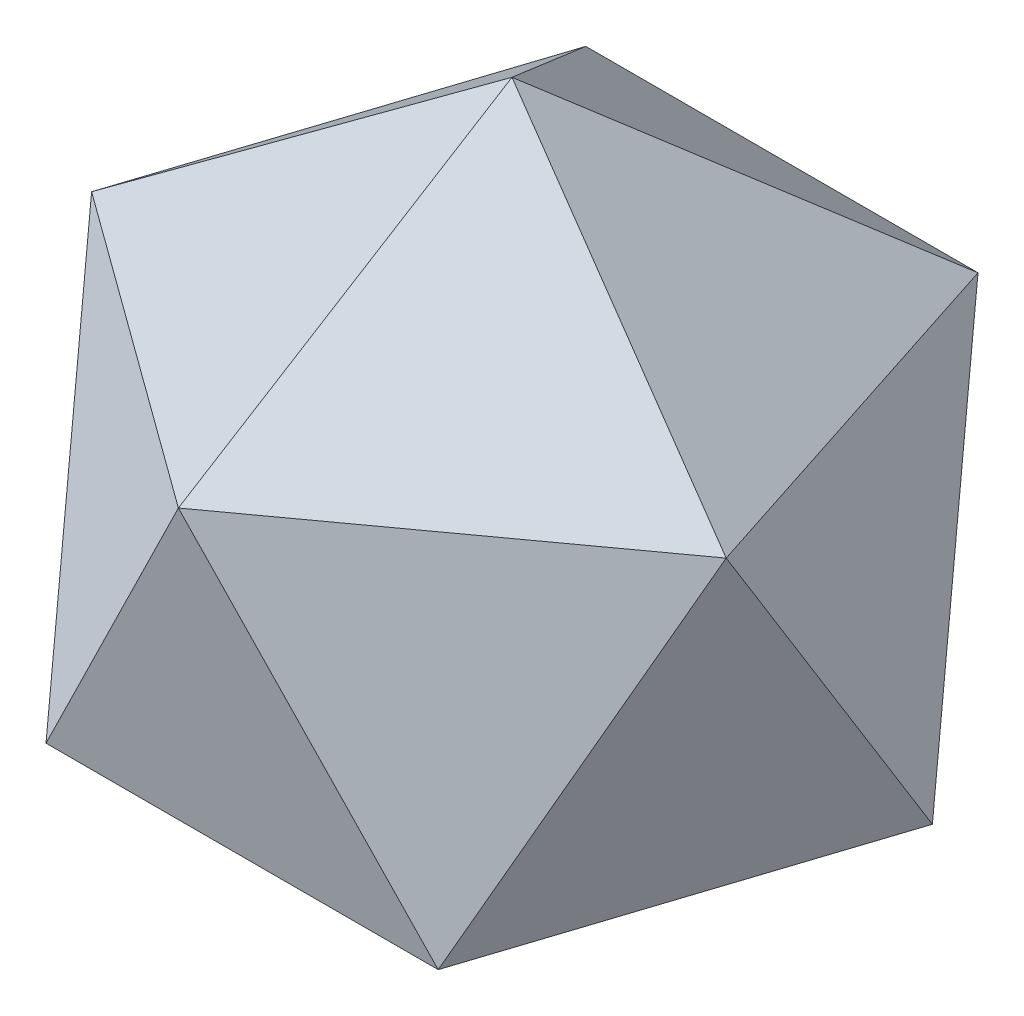
ISO-10303-21;
HEADER;
FILE_DESCRIPTION(('STEP AP214'),'2;1');
FILE_NAME('part.step','',(''),(''),'','','');
FILE_SCHEMA(('AUTOMOTIVE_DESIGN { 1 0 10303 214 1 1 1 1 }'));
ENDSEC;
DATA;
#1=APPLICATION_CONTEXT('core data for automotive mechanical design processes');
#2=APPLICATION_PROTOCOL_DEFINITION('international standard','automotive_design',2000,#1);
#3=PRODUCT_CONTEXT('',#1,'mechanical');
#4=PRODUCT('Part','Part','',(#3));
#5=PRODUCT_RELATED_PRODUCT_CATEGORY('part','',(#4));
#6=PRODUCT_DEFINITION_FORMATION('','',#4);
#7=PRODUCT_DEFINITION_CONTEXT('part definition',#1,'design');
#8=PRODUCT_DEFINITION('design','',#6,#7);
#9=PRODUCT_DEFINITION_SHAPE('','',#8);
#10=(LENGTH_UNIT() NAMED_UNIT(*) SI_UNIT(.MILLI.,.METRE.));
#11=(NAMED_UNIT(*) PLANE_ANGLE_UNIT() SI_UNIT($,.RADIAN.));
#12=(NAMED_UNIT(*) SI_UNIT($,.STERADIAN.) SOLID_ANGLE_UNIT());
#13=UNCERTAINTY_MEASURE_WITH_UNIT(LENGTH_MEASURE(1.E-05),#10,'distance_accuracy_value','');
#14=(GEOMETRIC_REPRESENTATION_CONTEXT(3) GLOBAL_UNCERTAINTY_ASSIGNED_CONTEXT((#13)) GLOBAL_UNIT_ASSIGNED_CONTEXT((#10,
#11,#12)) REPRESENTATION_CONTEXT('',''));
#15=CARTESIAN_POINT('',(0.,0.,0.));
#16=DIRECTION('',(0.,0.,1.));
#17=DIRECTION('',(1.,0.,0.));
#18=AXIS2_PLACEMENT_3D('',#15,#16,#17);
#19=CARTESIAN_POINT('',(-10.2589451239174,-3.33333333333333,-14.1202265916661));
#20=DIRECTION('',(0.577350269189618,0.187592474085079,0.794654472291772));
#21=DIRECTION('',(0.809016994374954,0.,-0.587785252292465));
#22=AXIS2_PLACEMENT_3D('',#19,#20,#21);
#23=PLANE('',#22);
#24=DIRECTION('',(0.809016994374954,0.,-0.587785252292465));
#25=VECTOR('',#24,1.);
#26=CARTESIAN_POINT('',(2.28983498828939E-13,0.,-22.3606797749979));
#27=LINE('',#26,#25);
#28=CARTESIAN_POINT('',(-21.266270208801,0.,-6.90983005625071));
#29=VERTEX_POINT('',#28);
#30=CARTESIAN_POINT('',(0.,0.,-22.3606797749979));
#31=VERTEX_POINT('',#30);
#32=EDGE_CURVE('E135',#29,#31,#27,.T.);
#33=ORIENTED_EDGE('',*,*,#32,.F.);
#34=DIRECTION('',(0.309016994374952,0.85065080835204,-0.425325404176017));
#35=VECTOR('',#34,1.);
#36=CARTESIAN_POINT('',(-13.1432778029782,22.3606797749979,-18.0901699437496));
#37=LINE('',#36,#35);
#38=CARTESIAN_POINT('',(-13.1432778029782,22.3606797749979,-18.0901699437496));
#39=VERTEX_POINT('',#38);
#40=EDGE_CURVE('E142',#29,#39,#37,.T.);
#41=ORIENTED_EDGE('',*,*,#40,.T.);
#42=DIRECTION('',(0.500000000000002,-0.85065080835204,-0.162459848116448));
#43=VECTOR('',#42,1.);
#44=CARTESIAN_POINT('',(-13.1432778029781,22.3606797749979,-18.0901699437496));
#45=LINE('',#44,#43);
#46=EDGE_CURVE('E153',#39,#31,#45,.T.);
#47=ORIENTED_EDGE('',*,*,#46,.T.);
#48=EDGE_LOOP('',(#33,#41,#47));
#49=FACE_BOUND('',#48,.T.);
#50=ADVANCED_FACE('F82',(#49),#23,.F.);
#51=CARTESIAN_POINT('',(-3.91856834861644,-8.72677996249966,-5.39344662916636));
#52=DIRECTION('',(0.356822089773085,0.794654472291766,0.491123473188427));
#53=DIRECTION('',(0.809016994374944,-0.525731112119134,0.262865556059576));
#54=AXIS2_PLACEMENT_3D('',#51,#52,#53);
#55=PLANE('',#54);
#56=DIRECTION('',(0.809016994374945,-0.525731112119134,0.262865556059573));
#57=VECTOR('',#56,1.);
#58=CARTESIAN_POINT('',(-21.266270208801,0.,-6.90983005625069));
#59=LINE('',#58,#57);
#60=CARTESIAN_POINT('',(0.,-13.8196601125011,0.));
#61=VERTEX_POINT('',#60);
#62=EDGE_CURVE('E152',#29,#61,#59,.T.);
#63=ORIENTED_EDGE('',*,*,#62,.F.);
#64=ORIENTED_EDGE('',*,*,#32,.T.);
#65=DIRECTION('',(0.,0.525731112119134,-0.85065080835204));
#66=VECTOR('',#65,1.);
#67=CARTESIAN_POINT('',(0.,0.,-22.3606797749979));
#68=LINE('',#67,#66);
#69=EDGE_CURVE('E158',#61,#31,#68,.T.);
#70=ORIENTED_EDGE('',*,*,#69,.F.);
#71=EDGE_LOOP('',(#63,#64,#70));
#72=FACE_BOUND('',#71,.T.);
#73=ADVANCED_FACE('F157',(#72),#55,.F.);
#74=CARTESIAN_POINT('',(2.51534904016637E-13,4.12022659166599,-21.5737865166653));
#75=DIRECTION('',(0.,0.187592474085081,-0.982246946376846));
#76=DIRECTION('',(-1.,0.,0.));
#77=AXIS2_PLACEMENT_3D('',#74,#75,#76);
#78=PLANE('',#77);
#79=DIRECTION('',(-0.5,-0.85065080835204,-0.162459848116453));
#80=VECTOR('',#79,1.);
#81=CARTESIAN_POINT('',(13.1432778029783,22.3606797749979,-18.0901699437495));
#82=LINE('',#81,#80);
#83=CARTESIAN_POINT('',(13.1432778029784,22.3606797749979,-18.0901699437495));
#84=VERTEX_POINT('',#83);
#85=EDGE_CURVE('E299',#84,#31,#82,.T.);
#86=ORIENTED_EDGE('',*,*,#85,.T.);
#87=ORIENTED_EDGE('',*,*,#46,.F.);
#88=DIRECTION('',(-1.,0.,0.));
#89=VECTOR('',#88,1.);
#90=CARTESIAN_POINT('',(13.1432778029785,22.3606797749979,-18.0901699437493));
#91=LINE('',#90,#89);
#92=EDGE_CURVE('E271',#84,#39,#91,.T.);
#93=ORIENTED_EDGE('',*,*,#92,.F.);
#94=EDGE_LOOP('',(#86,#87,#93));
#95=FACE_BOUND('',#94,.T.);
#96=ADVANCED_FACE('F479',(#95),#78,.T.);
#97=CARTESIAN_POINT('',(-20.517890247835,4.12022659166599,-6.66666666666686));
#98=DIRECTION('',(-0.934172358962713,0.187592474085081,-0.303530999103352));
#99=DIRECTION('',(-0.309016994374956,0.,0.951056516295151));
#100=AXIS2_PLACEMENT_3D('',#97,#98,#99);
#101=PLANE('',#100);
#102=ORIENTED_EDGE('',*,*,#40,.F.);
#103=DIRECTION('',(0.,0.85065080835204,0.525731112119133));
#104=VECTOR('',#103,1.);
#105=CARTESIAN_POINT('',(-21.2662702088011,22.3606797749979,6.90983005625035));
#106=LINE('',#105,#104);
#107=CARTESIAN_POINT('',(-21.266270208801,22.3606797749979,6.90983005625039));
#108=VERTEX_POINT('',#107);
#109=EDGE_CURVE('E145',#29,#108,#106,.T.);
#110=ORIENTED_EDGE('',*,*,#109,.T.);
#111=DIRECTION('',(-0.309016994374956,0.,0.951056516295151));
#112=VECTOR('',#111,1.);
#113=CARTESIAN_POINT('',(-13.1432778029782,22.3606797749979,-18.0901699437496));
#114=LINE('',#113,#112);
#115=EDGE_CURVE('E147',#39,#108,#114,.T.);
#116=ORIENTED_EDGE('',*,*,#115,.F.);
#117=EDGE_LOOP('',(#102,#110,#116));
#118=FACE_BOUND('',#117,.T.);
#119=ADVANCED_FACE('F143',(#118),#101,.T.);
#120=CARTESIAN_POINT('',(-6.34037677530105,-8.72677996249966,2.06011329583294));
#121=DIRECTION('',(0.577350269189627,0.794654472291766,-0.187592474085075));
#122=DIRECTION('',(0.500000000000006,-0.525731112119134,-0.688190960235582));
#123=AXIS2_PLACEMENT_3D('',#120,#121,#122);
#124=PLANE('',#123);
#125=DIRECTION('',(0.500000000000003,-0.525731112119133,-0.688190960235584));
#126=VECTOR('',#125,1.);
#127=CARTESIAN_POINT('',(-13.1432778029784,0.,18.0901699437494));
#128=LINE('',#127,#126);
#129=CARTESIAN_POINT('',(-13.1432778029784,0.,18.0901699437494));
#130=VERTEX_POINT('',#129);
#131=EDGE_CURVE('E174',#130,#61,#128,.T.);
#132=ORIENTED_EDGE('',*,*,#131,.F.);
#133=DIRECTION('',(-0.30901699437494,0.,-0.951056516295156));
#134=VECTOR('',#133,1.);
#135=CARTESIAN_POINT('',(-21.266270208801,0.,-6.9098300562507));
#136=LINE('',#135,#134);
#137=EDGE_CURVE('E165',#130,#29,#136,.T.);
#138=ORIENTED_EDGE('',*,*,#137,.T.);
#139=ORIENTED_EDGE('',*,*,#62,.T.);
#140=EDGE_LOOP('',(#132,#138,#139));
#141=FACE_BOUND('',#140,.T.);
#142=ADVANCED_FACE('F173',(#141),#124,.F.);
#143=CARTESIAN_POINT('',(-16.5993218992186,-3.33333333333333,5.39344662916619));
#144=DIRECTION('',(0.934172358962718,0.18759247408508,-0.303530999103336));
#145=DIRECTION('',(-0.30901699437494,0.,-0.951056516295156));
#146=AXIS2_PLACEMENT_3D('',#143,#144,#145);
#147=PLANE('',#146);
#148=ORIENTED_EDGE('',*,*,#137,.F.);
#149=DIRECTION('',(-0.309016994374945,0.85065080835204,-0.425325404176022));
#150=VECTOR('',#149,1.);
#151=CARTESIAN_POINT('',(-21.266270208801,22.3606797749979,6.90983005625043));
#152=LINE('',#151,#150);
#153=EDGE_CURVE('E170',#130,#108,#152,.T.);
#154=ORIENTED_EDGE('',*,*,#153,.T.);
#155=ORIENTED_EDGE('',*,*,#109,.F.);
#156=EDGE_LOOP('',(#148,#154,#155));
#157=FACE_BOUND('',#156,.T.);
#158=ADVANCED_FACE('F168',(#157),#147,.F.);
#159=CARTESIAN_POINT('',(3.91856834861649,-8.72677996249966,-5.39344662916633));
#160=DIRECTION('',(-0.356822089773089,0.794654472291766,0.491123473188424));
#161=DIRECTION('',(0.,-0.525731112119134,0.85065080835204));
#162=AXIS2_PLACEMENT_3D('',#159,#160,#161);
#163=PLANE('',#162);
#164=ORIENTED_EDGE('',*,*,#69,.T.);
#165=DIRECTION('',(0.809016994374948,0.,0.587785252292472));
#166=VECTOR('',#165,1.);
#167=CARTESIAN_POINT('',(21.266270208801,0.,-6.90983005625055));
#168=LINE('',#167,#166);
#169=CARTESIAN_POINT('',(21.266270208801,0.,-6.90983005625051));
#170=VERTEX_POINT('',#169);
#171=EDGE_CURVE('E213',#31,#170,#168,.T.);
#172=ORIENTED_EDGE('',*,*,#171,.T.);
#173=DIRECTION('',(0.809016994374948,0.525731112119134,-0.262865556059565));
#174=VECTOR('',#173,1.);
#175=CARTESIAN_POINT('',(21.266270208801,0.,-6.90983005625049));
#176=LINE('',#175,#174);
#177=EDGE_CURVE('E230',#61,#170,#176,.T.);
#178=ORIENTED_EDGE('',*,*,#177,.F.);
#179=EDGE_LOOP('',(#164,#172,#178));
#180=FACE_BOUND('',#179,.T.);
#181=ADVANCED_FACE('F499',(#180),#163,.F.);
#182=CARTESIAN_POINT('',(10.2589451239175,-3.33333333333333,-14.120226591666));
#183=DIRECTION('',(-0.577350269189625,0.18759247408508,0.794654472291767));
#184=DIRECTION('',(0.809016994374948,0.,0.587785252292472));
#185=AXIS2_PLACEMENT_3D('',#182,#183,#184);
#186=PLANE('',#185);
#187=ORIENTED_EDGE('',*,*,#171,.F.);
#188=ORIENTED_EDGE('',*,*,#85,.F.);
#189=DIRECTION('',(0.309016994374948,-0.85065080835204,0.42532540417602));
#190=VECTOR('',#189,1.);
#191=CARTESIAN_POINT('',(13.1432778029784,22.3606797749979,-18.0901699437495));
#192=LINE('',#191,#190);
#193=EDGE_CURVE('E316',#84,#170,#192,.T.);
#194=ORIENTED_EDGE('',*,*,#193,.T.);
#195=EDGE_LOOP('',(#187,#188,#194));
#196=FACE_BOUND('',#195,.T.);
#197=ADVANCED_FACE('F476',(#196),#186,.F.);
#198=CARTESIAN_POINT('',(2.02962646689286E-13,22.8470065541656,-17.4535599249993));
#199=DIRECTION('',(0.,0.794654472291766,-0.607061998206687));
#200=DIRECTION('',(-0.250000000000009,0.587785252292474,0.76942088429381));
#201=AXIS2_PLACEMENT_3D('',#198,#199,#200);
#202=PLANE('',#201);
#203=ORIENTED_EDGE('',*,*,#92,.T.);
#204=DIRECTION('',(-0.499999999999994,-0.525731112119134,-0.688190960235591));
#205=VECTOR('',#204,1.);
#206=CARTESIAN_POINT('',(0.,36.180339887499,0.));
#207=LINE('',#206,#205);
#208=CARTESIAN_POINT('',(0.,36.180339887499,0.));
#209=VERTEX_POINT('',#208);
#210=EDGE_CURVE('E255',#209,#39,#207,.T.);
#211=ORIENTED_EDGE('',*,*,#210,.F.);
#212=DIRECTION('',(-0.499999999999999,0.525731112119134,0.688190960235587));
#213=VECTOR('',#212,1.);
#214=CARTESIAN_POINT('',(0.,36.180339887499,0.));
#215=LINE('',#214,#213);
#216=EDGE_CURVE('E290',#84,#209,#215,.T.);
#217=ORIENTED_EDGE('',*,*,#216,.F.);
#218=EDGE_LOOP('',(#203,#211,#217));
#219=FACE_BOUND('',#218,.T.);
#220=ADVANCED_FACE('F483',(#219),#202,.T.);
#221=CARTESIAN_POINT('',(-16.5993218992185,22.8470065541656,-5.39344662916647));
#222=DIRECTION('',(-0.577350269189625,0.794654472291766,-0.187592474085085));
#223=DIRECTION('',(0.654508497187469,0.587785252292474,0.475528258147582));
#224=AXIS2_PLACEMENT_3D('',#221,#222,#223);
#225=PLANE('',#224);
#226=ORIENTED_EDGE('',*,*,#115,.T.);
#227=DIRECTION('',(-0.809016994374948,-0.525731112119134,0.262865556059562));
#228=VECTOR('',#227,1.);
#229=CARTESIAN_POINT('',(0.,36.180339887499,0.));
#230=LINE('',#229,#228);
#231=EDGE_CURVE('E276',#209,#108,#230,.T.);
#232=ORIENTED_EDGE('',*,*,#231,.F.);
#233=ORIENTED_EDGE('',*,*,#210,.T.);
#234=EDGE_LOOP('',(#226,#232,#233));
#235=FACE_BOUND('',#234,.T.);
#236=ADVANCED_FACE('F534',(#235),#225,.T.);
#237=CARTESIAN_POINT('',(0.,-8.72677996249966,6.66666666666667));
#238=DIRECTION('',(0.,0.794654472291766,-0.607061998206686));
#239=DIRECTION('',(-0.499999999999996,-0.525731112119134,-0.68819096023559));
#240=AXIS2_PLACEMENT_3D('',#237,#238,#239);
#241=PLANE('',#240);
#242=DIRECTION('',(-0.499999999999999,-0.525731112119134,-0.688190960235588));
#243=VECTOR('',#242,1.);
#244=CARTESIAN_POINT('',(13.1432778029783,0.,18.0901699437495));
#245=LINE('',#244,#243);
#246=CARTESIAN_POINT('',(13.1432778029783,0.,18.0901699437495));
#247=VERTEX_POINT('',#246);
#248=EDGE_CURVE('E335',#247,#61,#245,.T.);
#249=ORIENTED_EDGE('',*,*,#248,.F.);
#250=DIRECTION('',(-1.,0.,0.));
#251=VECTOR('',#250,1.);
#252=CARTESIAN_POINT('',(-13.1432778029784,0.,18.0901699437494));
#253=LINE('',#252,#251);
#254=EDGE_CURVE('E281',#247,#130,#253,.T.);
#255=ORIENTED_EDGE('',*,*,#254,.T.);
#256=ORIENTED_EDGE('',*,*,#131,.T.);
#257=EDGE_LOOP('',(#249,#255,#256));
#258=FACE_BOUND('',#257,.T.);
#259=ADVANCED_FACE('F495',(#258),#241,.F.);
#260=CARTESIAN_POINT('',(-12.6807535506022,4.12022659166599,17.4535599249993));
#261=DIRECTION('',(-0.577350269189631,0.187592474085081,0.794654472291763));
#262=DIRECTION('',(0.809016994374944,0.,0.587785252292478));
#263=AXIS2_PLACEMENT_3D('',#260,#261,#262);
#264=PLANE('',#263);
#265=ORIENTED_EDGE('',*,*,#153,.F.);
#266=DIRECTION('',(0.499999999999999,0.85065080835204,0.162459848116455));
#267=VECTOR('',#266,1.);
#268=CARTESIAN_POINT('',(-1.16226472890446E-13,22.3606797749979,22.3606797749979));
#269=LINE('',#268,#267);
#270=CARTESIAN_POINT('',(0.,22.3606797749979,22.3606797749979));
#271=VERTEX_POINT('',#270);
#272=EDGE_CURVE('E358',#130,#271,#269,.T.);
#273=ORIENTED_EDGE('',*,*,#272,.T.);
#274=DIRECTION('',(0.809016994374944,0.,0.587785252292478));
#275=VECTOR('',#274,1.);
#276=CARTESIAN_POINT('',(-21.266270208801,22.3606797749979,6.90983005625042));
#277=LINE('',#276,#275);
#278=EDGE_CURVE('E101',#108,#271,#277,.T.);
#279=ORIENTED_EDGE('',*,*,#278,.F.);
#280=EDGE_LOOP('',(#265,#273,#279));
#281=FACE_BOUND('',#280,.T.);
#282=ADVANCED_FACE('F528',(#281),#264,.T.);
#283=CARTESIAN_POINT('',(6.34037677530103,-8.72677996249966,2.060113295833));
#284=DIRECTION('',(-0.577350269189626,0.794654472291766,-0.187592474085081));
#285=DIRECTION('',(-0.809016994374948,-0.525731112119134,0.262865556059564));
#286=AXIS2_PLACEMENT_3D('',#283,#284,#285);
#287=PLANE('',#286);
#288=ORIENTED_EDGE('',*,*,#177,.T.);
#289=DIRECTION('',(-0.309016994374949,0.,0.951056516295153));
#290=VECTOR('',#289,1.);
#291=CARTESIAN_POINT('',(13.1432778029783,0.,18.0901699437495));
#292=LINE('',#291,#290);
#293=EDGE_CURVE('E353',#170,#247,#292,.T.);
#294=ORIENTED_EDGE('',*,*,#293,.T.);
#295=ORIENTED_EDGE('',*,*,#248,.T.);
#296=EDGE_LOOP('',(#288,#294,#295));
#297=FACE_BOUND('',#296,.T.);
#298=ADVANCED_FACE('F497',(#297),#287,.F.);
#299=CARTESIAN_POINT('',(20.5178902478351,4.12022659166599,-6.66666666666667));
#300=DIRECTION('',(0.934172358962716,0.187592474085081,-0.303530999103343));
#301=DIRECTION('',(-0.309016994374947,0.,-0.951056516295154));
#302=AXIS2_PLACEMENT_3D('',#299,#300,#301);
#303=PLANE('',#302);
#304=DIRECTION('',(0.,-0.85065080835204,-0.525731112119134));
#305=VECTOR('',#304,1.);
#306=CARTESIAN_POINT('',(21.266270208801,22.3606797749979,6.90983005625058));
#307=LINE('',#306,#305);
#308=CARTESIAN_POINT('',(21.266270208801,22.3606797749979,6.90983005625058));
#309=VERTEX_POINT('',#308);
#310=EDGE_CURVE('E346',#309,#170,#307,.T.);
#311=ORIENTED_EDGE('',*,*,#310,.T.);
#312=ORIENTED_EDGE('',*,*,#193,.F.);
#313=DIRECTION('',(-0.309016994374948,0.,-0.951056516295154));
#314=VECTOR('',#313,1.);
#315=CARTESIAN_POINT('',(21.266270208801,22.3606797749979,6.90983005625051));
#316=LINE('',#315,#314);
#317=EDGE_CURVE('E307',#309,#84,#316,.T.);
#318=ORIENTED_EDGE('',*,*,#317,.F.);
#319=EDGE_LOOP('',(#311,#312,#318));
#320=FACE_BOUND('',#319,.T.);
#321=ADVANCED_FACE('F468',(#320),#303,.T.);
#322=CARTESIAN_POINT('',(16.5993218992186,22.8470065541656,-5.39344662916632));
#323=DIRECTION('',(0.577350269189627,0.794654472291766,-0.18759247408508));
#324=DIRECTION('',(-0.809016994374947,0.587785252292474,0.));
#325=AXIS2_PLACEMENT_3D('',#322,#323,#324);
#326=PLANE('',#325);
#327=ORIENTED_EDGE('',*,*,#317,.T.);
#328=ORIENTED_EDGE('',*,*,#216,.T.);
#329=DIRECTION('',(-0.809016994374947,0.525731112119134,-0.262865556059569));
#330=VECTOR('',#329,1.);
#331=CARTESIAN_POINT('',(0.,36.180339887499,0.));
#332=LINE('',#331,#330);
#333=EDGE_CURVE('E400',#309,#209,#332,.T.);
#334=ORIENTED_EDGE('',*,*,#333,.F.);
#335=EDGE_LOOP('',(#327,#328,#334));
#336=FACE_BOUND('',#335,.T.);
#337=ADVANCED_FACE('F485',(#336),#326,.T.);
#338=CARTESIAN_POINT('',(-10.2589451239176,22.8470065541656,14.1202265916659));
#339=DIRECTION('',(-0.356822089773093,0.794654472291766,0.491123473188422));
#340=DIRECTION('',(0.654508497187476,0.587785252292474,-0.475528258147573));
#341=AXIS2_PLACEMENT_3D('',#338,#339,#340);
#342=PLANE('',#341);
#343=ORIENTED_EDGE('',*,*,#278,.T.);
#344=DIRECTION('',(0.,-0.525731112119135,0.85065080835204));
#345=VECTOR('',#344,1.);
#346=CARTESIAN_POINT('',(0.,36.180339887499,0.));
#347=LINE('',#346,#345);
#348=EDGE_CURVE('E392',#209,#271,#347,.T.);
#349=ORIENTED_EDGE('',*,*,#348,.F.);
#350=ORIENTED_EDGE('',*,*,#231,.T.);
#351=EDGE_LOOP('',(#343,#349,#350));
#352=FACE_BOUND('',#351,.T.);
#353=ADVANCED_FACE('F519',(#352),#342,.T.);
#354=CARTESIAN_POINT('',(0.,-3.33333333333333,17.4535599249993));
#355=DIRECTION('',(0.,0.18759247408508,-0.982246946376846));
#356=DIRECTION('',(-1.,0.,0.));
#357=AXIS2_PLACEMENT_3D('',#354,#355,#356);
#358=PLANE('',#357);
#359=ORIENTED_EDGE('',*,*,#254,.F.);
#360=DIRECTION('',(-0.500000000000001,0.85065080835204,0.162459848116451));
#361=VECTOR('',#360,1.);
#362=CARTESIAN_POINT('',(0.,22.3606797749979,22.3606797749979));
#363=LINE('',#362,#361);
#364=EDGE_CURVE('E370',#247,#271,#363,.T.);
#365=ORIENTED_EDGE('',*,*,#364,.T.);
#366=ORIENTED_EDGE('',*,*,#272,.F.);
#367=EDGE_LOOP('',(#359,#365,#366));
#368=FACE_BOUND('',#367,.T.);
#369=ADVANCED_FACE('F492',(#368),#358,.F.);
#370=CARTESIAN_POINT('',(16.5993218992185,-3.33333333333333,5.39344662916636));
#371=DIRECTION('',(-0.934172358962715,0.18759247408508,-0.303530999103345));
#372=DIRECTION('',(-0.309016994374949,0.,0.951056516295153));
#373=AXIS2_PLACEMENT_3D('',#370,#371,#372);
#374=PLANE('',#373);
#375=ORIENTED_EDGE('',*,*,#293,.F.);
#376=ORIENTED_EDGE('',*,*,#310,.F.);
#377=DIRECTION('',(-0.309016994374948,-0.85065080835204,0.42532540417602));
#378=VECTOR('',#377,1.);
#379=CARTESIAN_POINT('',(21.266270208801,22.3606797749979,6.9098300562506));
#380=LINE('',#379,#378);
#381=EDGE_CURVE('E92',#309,#247,#380,.T.);
#382=ORIENTED_EDGE('',*,*,#381,.T.);
#383=EDGE_LOOP('',(#375,#376,#382));
#384=FACE_BOUND('',#383,.T.);
#385=ADVANCED_FACE('F472',(#384),#374,.F.);
#386=CARTESIAN_POINT('',(10.2589451239175,22.8470065541656,14.120226591666));
#387=DIRECTION('',(0.356822089773089,0.794654472291766,0.491123473188425));
#388=DIRECTION('',(-0.249999999999998,0.587785252292474,-0.769420884293814));
#389=AXIS2_PLACEMENT_3D('',#386,#387,#388);
#390=PLANE('',#389);
#391=DIRECTION('',(0.80901699437495,0.,-0.587785252292471));
#392=VECTOR('',#391,1.);
#393=CARTESIAN_POINT('',(0.,22.3606797749979,22.3606797749979));
#394=LINE('',#393,#392);
#395=EDGE_CURVE('E13',#271,#309,#394,.T.);
#396=ORIENTED_EDGE('',*,*,#395,.T.);
#397=ORIENTED_EDGE('',*,*,#333,.T.);
#398=ORIENTED_EDGE('',*,*,#348,.T.);
#399=EDGE_LOOP('',(#396,#397,#398));
#400=FACE_BOUND('',#399,.T.);
#401=ADVANCED_FACE('F487',(#400),#390,.T.);
#402=CARTESIAN_POINT('',(12.680753550602,4.12022659166599,17.4535599249994));
#403=DIRECTION('',(0.577350269189623,0.187592474085081,0.794654472291768));
#404=DIRECTION('',(0.809016994374949,0.,-0.587785252292471));
#405=AXIS2_PLACEMENT_3D('',#402,#403,#404);
#406=PLANE('',#405);
#407=ORIENTED_EDGE('',*,*,#364,.F.);
#408=ORIENTED_EDGE('',*,*,#381,.F.);
#409=ORIENTED_EDGE('',*,*,#395,.F.);
#410=EDGE_LOOP('',(#407,#408,#409));
#411=FACE_BOUND('',#410,.T.);
#412=ADVANCED_FACE('F490',(#411),#406,.T.);
#413=CLOSED_SHELL('',(#50,#73,#96,#119,#142,#158,#181,#197,#220,#236,#259,#282,#298,#321,#337,
#353,#369,#385,#401,#412));
#414=MANIFOLD_SOLID_BREP('B2',#413);
#415=ADVANCED_BREP_SHAPE_REPRESENTATION('',(#18,#414),#14);
#416=SHAPE_DEFINITION_REPRESENTATION(#9,#415);
ENDSEC;
END-ISO-10303-21;
